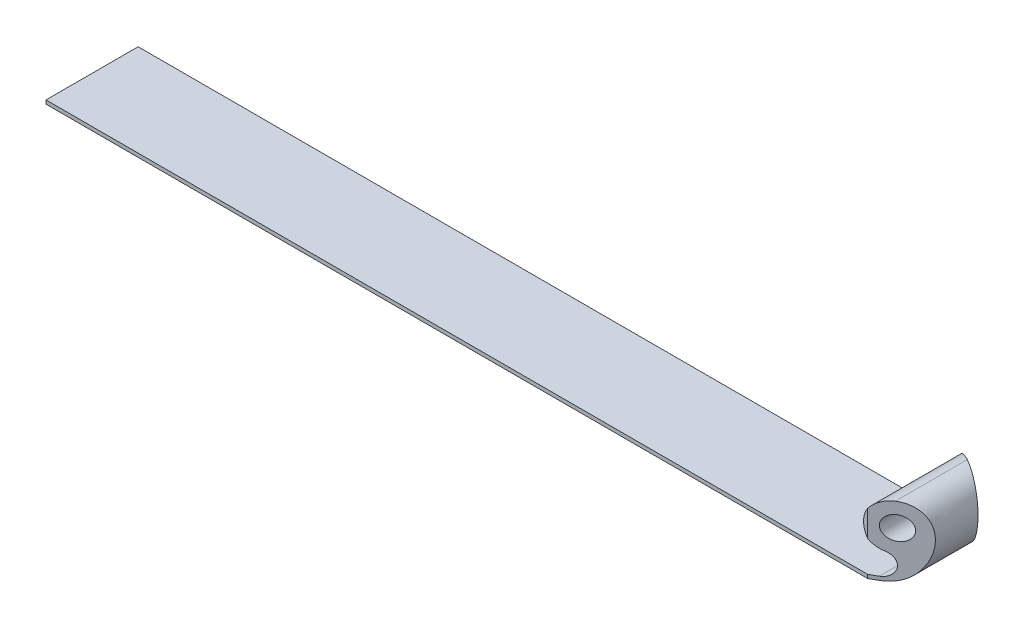
ISO-10303-21;
HEADER;
FILE_DESCRIPTION(('STEP AP214'),'2;1');
FILE_NAME('part.step','',(''),(''),'','','');
FILE_SCHEMA(('AUTOMOTIVE_DESIGN { 1 0 10303 214 1 1 1 1 }'));
ENDSEC;
DATA;
#1=APPLICATION_CONTEXT('core data for automotive mechanical design processes');
#2=APPLICATION_PROTOCOL_DEFINITION('international standard','automotive_design',2000,#1);
#3=PRODUCT_CONTEXT('',#1,'mechanical');
#4=PRODUCT('Part','Part','',(#3));
#5=PRODUCT_RELATED_PRODUCT_CATEGORY('part','',(#4));
#6=PRODUCT_DEFINITION_FORMATION('','',#4);
#7=PRODUCT_DEFINITION_CONTEXT('part definition',#1,'design');
#8=PRODUCT_DEFINITION('design','',#6,#7);
#9=PRODUCT_DEFINITION_SHAPE('','',#8);
#10=(LENGTH_UNIT() NAMED_UNIT(*) SI_UNIT(.MILLI.,.METRE.));
#11=(NAMED_UNIT(*) PLANE_ANGLE_UNIT() SI_UNIT($,.RADIAN.));
#12=(NAMED_UNIT(*) SI_UNIT($,.STERADIAN.) SOLID_ANGLE_UNIT());
#13=UNCERTAINTY_MEASURE_WITH_UNIT(LENGTH_MEASURE(1.E-05),#10,'distance_accuracy_value','');
#14=(GEOMETRIC_REPRESENTATION_CONTEXT(3) GLOBAL_UNCERTAINTY_ASSIGNED_CONTEXT((#13)) GLOBAL_UNIT_ASSIGNED_CONTEXT((#10,
#11,#12)) REPRESENTATION_CONTEXT('',''));
#15=CARTESIAN_POINT('',(0.,0.,0.));
#16=DIRECTION('',(0.,0.,1.));
#17=DIRECTION('',(1.,0.,0.));
#18=AXIS2_PLACEMENT_3D('',#15,#16,#17);
#19=CARTESIAN_POINT('',(0.,1.016,-12.7));
#20=DIRECTION('',(0.,0.,1.));
#21=DIRECTION('',(1.,0.,0.));
#22=AXIS2_PLACEMENT_3D('',#19,#20,#21);
#23=PLANE('',#22);
#24=CARTESIAN_POINT('',(231.775,13.1712561210692,-12.7));
#25=DIRECTION('',(0.,0.,-1.));
#26=DIRECTION('',(-1.,0.,0.));
#27=AXIS2_PLACEMENT_3D('',#24,#25,#26);
#28=CIRCLE('',#27,6.35);
#29=CARTESIAN_POINT('',(226.576403152688,9.52473849199963,-12.7));
#30=VERTEX_POINT('',#29);
#31=CARTESIAN_POINT('',(226.576403152688,16.8177737501387,-12.7));
#32=VERTEX_POINT('',#31);
#33=EDGE_CURVE('E236',#30,#32,#28,.T.);
#34=ORIENTED_EDGE('',*,*,#33,.T.);
#35=DIRECTION('',(0.,-1.,0.));
#36=VECTOR('',#35,1.);
#37=CARTESIAN_POINT('',(226.576403152688,19.6595705539557,-12.7));
#38=LINE('',#37,#36);
#39=EDGE_CURVE('E132',#32,#30,#38,.T.);
#40=ORIENTED_EDGE('',*,*,#39,.T.);
#41=EDGE_LOOP('',(#34,#40));
#42=FACE_BOUND('',#41,.T.);
#43=ADVANCED_FACE('F33',(#42),#23,.F.);
#44=CARTESIAN_POINT('',(0.,1.016,12.7));
#45=DIRECTION('',(0.,0.,-1.));
#46=DIRECTION('',(-1.,0.,0.));
#47=AXIS2_PLACEMENT_3D('',#44,#45,#46);
#48=PLANE('',#47);
#49=DIRECTION('',(1.,0.,0.));
#50=VECTOR('',#49,1.);
#51=CARTESIAN_POINT('',(0.,0.,12.7));
#52=LINE('',#51,#50);
#53=CARTESIAN_POINT('',(0.,0.,12.7));
#54=VERTEX_POINT('',#53);
#55=CARTESIAN_POINT('',(226.576403152688,0.,12.7));
#56=VERTEX_POINT('',#55);
#57=EDGE_CURVE('E128',#54,#56,#52,.T.);
#58=ORIENTED_EDGE('',*,*,#57,.T.);
#59=DIRECTION('',(0.,-1.,0.));
#60=VECTOR('',#59,1.);
#61=CARTESIAN_POINT('',(226.576403152688,19.6595705539557,12.7));
#62=LINE('',#61,#60);
#63=CARTESIAN_POINT('',(226.576403152688,1.016,12.7));
#64=VERTEX_POINT('',#63);
#65=EDGE_CURVE('E110',#64,#56,#62,.T.);
#66=ORIENTED_EDGE('',*,*,#65,.F.);
#67=DIRECTION('',(1.,0.,0.));
#68=VECTOR('',#67,1.);
#69=CARTESIAN_POINT('',(0.,1.016,12.7));
#70=LINE('',#69,#68);
#71=CARTESIAN_POINT('',(0.,1.016,12.7));
#72=VERTEX_POINT('',#71);
#73=EDGE_CURVE('E147',#72,#64,#70,.T.);
#74=ORIENTED_EDGE('',*,*,#73,.F.);
#75=DIRECTION('',(0.,-1.,0.));
#76=VECTOR('',#75,1.);
#77=CARTESIAN_POINT('',(0.,1.016,12.7));
#78=LINE('',#77,#76);
#79=EDGE_CURVE('E42',#72,#54,#78,.T.);
#80=ORIENTED_EDGE('',*,*,#79,.T.);
#81=EDGE_LOOP('',(#58,#66,#74,#80));
#82=FACE_BOUND('',#81,.T.);
#83=ADVANCED_FACE('F135',(#82),#48,.F.);
#84=DIRECTION('',(-1.,0.,0.));
#85=VECTOR('',#84,1.);
#86=CARTESIAN_POINT('',(0.,1.016,-12.7));
#87=LINE('',#86,#85);
#88=CARTESIAN_POINT('',(226.576403152688,1.016,-12.7));
#89=VERTEX_POINT('',#88);
#90=CARTESIAN_POINT('',(0.,1.016,-12.7));
#91=VERTEX_POINT('',#90);
#92=EDGE_CURVE('E141',#89,#91,#87,.T.);
#93=ORIENTED_EDGE('',*,*,#92,.F.);
#94=CARTESIAN_POINT('',(226.576403152688,0.,-12.7));
#95=VERTEX_POINT('',#94);
#96=EDGE_CURVE('E158',#89,#95,#38,.T.);
#97=ORIENTED_EDGE('',*,*,#96,.T.);
#98=DIRECTION('',(-1.,0.,0.));
#99=VECTOR('',#98,1.);
#100=CARTESIAN_POINT('',(0.,0.,-12.7));
#101=LINE('',#100,#99);
#102=CARTESIAN_POINT('',(0.,0.,-12.7));
#103=VERTEX_POINT('',#102);
#104=EDGE_CURVE('E143',#95,#103,#101,.T.);
#105=ORIENTED_EDGE('',*,*,#104,.T.);
#106=DIRECTION('',(0.,-1.,0.));
#107=VECTOR('',#106,1.);
#108=CARTESIAN_POINT('',(0.,1.016,-12.7));
#109=LINE('',#108,#107);
#110=EDGE_CURVE('E11',#91,#103,#109,.T.);
#111=ORIENTED_EDGE('',*,*,#110,.F.);
#112=EDGE_LOOP('',(#93,#97,#105,#111));
#113=FACE_BOUND('',#112,.T.);
#114=ADVANCED_FACE('F35',(#113),#23,.F.);
#115=CARTESIAN_POINT('',(0.,1.016,12.7));
#116=DIRECTION('',(1.,0.,0.));
#117=DIRECTION('',(0.,0.,-1.));
#118=AXIS2_PLACEMENT_3D('',#115,#116,#117);
#119=PLANE('',#118);
#120=DIRECTION('',(0.,0.,1.));
#121=VECTOR('',#120,1.);
#122=CARTESIAN_POINT('',(0.,0.,12.7));
#123=LINE('',#122,#121);
#124=EDGE_CURVE('E138',#103,#54,#123,.T.);
#125=ORIENTED_EDGE('',*,*,#124,.T.);
#126=ORIENTED_EDGE('',*,*,#79,.F.);
#127=DIRECTION('',(0.,0.,1.));
#128=VECTOR('',#127,1.);
#129=CARTESIAN_POINT('',(0.,1.016,12.7));
#130=LINE('',#129,#128);
#131=EDGE_CURVE('E213',#91,#72,#130,.T.);
#132=ORIENTED_EDGE('',*,*,#131,.F.);
#133=ORIENTED_EDGE('',*,*,#110,.T.);
#134=EDGE_LOOP('',(#125,#126,#132,#133));
#135=FACE_BOUND('',#134,.T.);
#136=ADVANCED_FACE('F202',(#135),#119,.F.);
#137=CARTESIAN_POINT('',(231.775,13.1712561210692,12.7));
#138=DIRECTION('',(0.,0.,-1.));
#139=DIRECTION('',(-1.,0.,0.));
#140=AXIS2_PLACEMENT_3D('',#137,#138,#139);
#141=CIRCLE('',#140,6.35);
#142=CARTESIAN_POINT('',(226.576403152688,9.52473849199965,12.7));
#143=VERTEX_POINT('',#142);
#144=CARTESIAN_POINT('',(226.576403152688,16.8177737501387,12.7));
#145=VERTEX_POINT('',#144);
#146=EDGE_CURVE('E232',#143,#145,#141,.T.);
#147=ORIENTED_EDGE('',*,*,#146,.F.);
#148=EDGE_CURVE('E50',#145,#143,#62,.T.);
#149=ORIENTED_EDGE('',*,*,#148,.F.);
#150=EDGE_LOOP('',(#147,#149));
#151=FACE_BOUND('',#150,.T.);
#152=ADVANCED_FACE('F199',(#151),#48,.F.);
#153=CARTESIAN_POINT('',(0.,1.016,0.));
#154=DIRECTION('',(0.,-1.,0.));
#155=DIRECTION('',(0.,0.,-1.));
#156=AXIS2_PLACEMENT_3D('',#153,#154,#155);
#157=PLANE('',#156);
#158=ORIENTED_EDGE('',*,*,#73,.T.);
#159=DIRECTION('',(0.866025403784438,0.,-0.500000000000001));
#160=VECTOR('',#159,1.);
#161=CARTESIAN_POINT('',(62.1433621022032,1.016,107.635460514166));
#162=LINE('',#161,#160);
#163=CARTESIAN_POINT('',(228.6,1.016,11.5316758154729));
#164=VERTEX_POINT('',#163);
#165=EDGE_CURVE('E117',#64,#164,#162,.T.);
#166=ORIENTED_EDGE('',*,*,#165,.T.);
#167=DIRECTION('',(0.,0.,-1.));
#168=VECTOR('',#167,1.);
#169=CARTESIAN_POINT('',(228.6,1.016,12.7));
#170=LINE('',#169,#168);
#171=CARTESIAN_POINT('',(228.6,1.016,-11.531675815473));
#172=VERTEX_POINT('',#171);
#173=EDGE_CURVE('E137',#164,#172,#170,.T.);
#174=ORIENTED_EDGE('',*,*,#173,.T.);
#175=DIRECTION('',(-0.866025403784438,0.,-0.500000000000001));
#176=VECTOR('',#175,1.);
#177=CARTESIAN_POINT('',(62.1433621022032,1.016,-107.635460514166));
#178=LINE('',#177,#176);
#179=EDGE_CURVE('E162',#172,#89,#178,.T.);
#180=ORIENTED_EDGE('',*,*,#179,.T.);
#181=ORIENTED_EDGE('',*,*,#92,.T.);
#182=ORIENTED_EDGE('',*,*,#131,.T.);
#183=EDGE_LOOP('',(#158,#166,#174,#180,#181,#182));
#184=FACE_BOUND('',#183,.T.);
#185=ADVANCED_FACE('F220',(#184),#157,.F.);
#186=CARTESIAN_POINT('',(0.,0.,0.));
#187=DIRECTION('',(0.,-1.,0.));
#188=DIRECTION('',(0.,0.,-1.));
#189=AXIS2_PLACEMENT_3D('',#186,#187,#188);
#190=PLANE('',#189);
#191=DIRECTION('',(0.866025403784438,0.,-0.500000000000001));
#192=VECTOR('',#191,1.);
#193=CARTESIAN_POINT('',(226.576403152688,0.,12.7));
#194=LINE('',#193,#192);
#195=CARTESIAN_POINT('',(228.6,0.,11.5316758154729));
#196=VERTEX_POINT('',#195);
#197=EDGE_CURVE('E114',#56,#196,#194,.T.);
#198=ORIENTED_EDGE('',*,*,#197,.F.);
#199=ORIENTED_EDGE('',*,*,#57,.F.);
#200=ORIENTED_EDGE('',*,*,#124,.F.);
#201=ORIENTED_EDGE('',*,*,#104,.F.);
#202=DIRECTION('',(-0.866025403784438,0.,-0.500000000000001));
#203=VECTOR('',#202,1.);
#204=CARTESIAN_POINT('',(226.576403152688,0.,-12.7));
#205=LINE('',#204,#203);
#206=CARTESIAN_POINT('',(228.6,0.,-11.531675815473));
#207=VERTEX_POINT('',#206);
#208=EDGE_CURVE('E156',#207,#95,#205,.T.);
#209=ORIENTED_EDGE('',*,*,#208,.F.);
#210=DIRECTION('',(0.,0.,-1.));
#211=VECTOR('',#210,1.);
#212=CARTESIAN_POINT('',(228.6,0.,12.7));
#213=LINE('',#212,#211);
#214=EDGE_CURVE('E131',#196,#207,#213,.T.);
#215=ORIENTED_EDGE('',*,*,#214,.F.);
#216=EDGE_LOOP('',(#198,#199,#200,#201,#209,#215));
#217=FACE_BOUND('',#216,.T.);
#218=ADVANCED_FACE('F126',(#217),#190,.T.);
#219=CARTESIAN_POINT('',(228.6,4.191,12.7));
#220=DIRECTION('',(0.,0.,-1.));
#221=DIRECTION('',(-1.,0.,0.));
#222=AXIS2_PLACEMENT_3D('',#219,#220,#221);
#223=CYLINDRICAL_SURFACE('',#222,3.175);
#224=CARTESIAN_POINT('',(228.6,4.191,11.531675815473));
#225=DIRECTION('',(-0.500000000000001,0.,-0.866025403784438));
#226=DIRECTION('',(0.866025403784438,0.,-0.500000000000001));
#227=AXIS2_PLACEMENT_3D('',#224,#225,#226);
#228=ELLIPSE('',#227,3.66617420935412,3.175);
#229=CARTESIAN_POINT('',(229.658333333333,7.18441870702305,10.9206467805806));
#230=VERTEX_POINT('',#229);
#231=EDGE_CURVE('E223',#230,#164,#228,.T.);
#232=ORIENTED_EDGE('',*,*,#231,.F.);
#233=DIRECTION('',(0.,0.,-1.));
#234=VECTOR('',#233,1.);
#235=CARTESIAN_POINT('',(229.658333333333,7.18441870702305,12.7));
#236=LINE('',#235,#234);
#237=CARTESIAN_POINT('',(229.658333333333,7.18441870702305,-10.9206467805806));
#238=VERTEX_POINT('',#237);
#239=EDGE_CURVE('E230',#230,#238,#236,.T.);
#240=ORIENTED_EDGE('',*,*,#239,.T.);
#241=CARTESIAN_POINT('',(228.6,4.191,-11.531675815473));
#242=DIRECTION('',(-0.500000000000001,0.,0.866025403784438));
#243=DIRECTION('',(-0.866025403784438,0.,-0.500000000000001));
#244=AXIS2_PLACEMENT_3D('',#241,#242,#243);
#245=ELLIPSE('',#244,3.66617420935412,3.175);
#246=EDGE_CURVE('E58',#172,#238,#245,.T.);
#247=ORIENTED_EDGE('',*,*,#246,.F.);
#248=ORIENTED_EDGE('',*,*,#173,.F.);
#249=EDGE_LOOP('',(#232,#240,#247,#248));
#250=FACE_BOUND('',#249,.T.);
#251=ADVANCED_FACE('F227',(#250),#223,.F.);
#252=CARTESIAN_POINT('',(231.38123789868,19.5090358117467,12.7));
#253=CARTESIAN_POINT('',(236.227087860959,19.8101052961647,12.7));
#254=CARTESIAN_POINT('',(241.340763981735,15.1060283719887,12.7));
#255=CARTESIAN_POINT('',(239.097965646525,8.03162983332433,12.7));
#256=CARTESIAN_POINT('',(236.573095562569,0.,12.7));
#257=CARTESIAN_POINT('',(228.6,0.,12.7));
#258=B_SPLINE_CURVE_WITH_KNOTS('',5,(#252,#253,#254,#255,#256,#257),.UNSPECIFIED.,.F.,.F.,(6,6),
(0.,1.),.UNSPECIFIED.);
#259=DIRECTION('',(0.,0.,-1.));
#260=VECTOR('',#259,1.);
#261=SURFACE_OF_LINEAR_EXTRUSION('',#258,#260);
#262=CARTESIAN_POINT('',(228.6,0.,11.5316758154729));
#263=CARTESIAN_POINT('',(228.774822040463,-9.49278637033649E-06,11.4307422633511));
#264=CARTESIAN_POINT('',(228.949670058046,0.00463314932721364,11.3297937133328));
#265=CARTESIAN_POINT('',(229.299159344152,0.0237665320454884,11.1280159799205));
#266=CARTESIAN_POINT('',(229.473800142951,0.0382686035590656,11.0271870677222));
#267=CARTESIAN_POINT('',(229.822264715094,0.0776731636921122,10.8260009531922));
#268=CARTESIAN_POINT('',(229.996088223416,0.102578818399091,10.7256439038711));
#269=CARTESIAN_POINT('',(230.342286291478,0.16322318177325,10.5257663560826));
#270=CARTESIAN_POINT('',(230.514661110646,0.198959906444537,10.4262457078348));
#271=CARTESIAN_POINT('',(230.857340568932,0.281583661291981,10.2283996303474));
#272=CARTESIAN_POINT('',(231.027645892226,0.328466894856992,10.1300738060992));
#273=CARTESIAN_POINT('',(231.365591377373,0.433574467425711,9.934960889278));
#274=CARTESIAN_POINT('',(231.533231900128,0.491797256280907,9.83817358833857));
#275=CARTESIAN_POINT('',(231.866220935901,0.620008015462059,9.64592227889765));
#276=CARTESIAN_POINT('',(232.031549787319,0.690064157687513,9.55046962202682));
#277=CARTESIAN_POINT('',(232.358274736072,0.841585100451611,9.36183488491301));
#278=CARTESIAN_POINT('',(232.519670120788,0.923051950475404,9.2686532161013));
#279=CARTESIAN_POINT('',(232.837899493955,1.09710282454696,9.08492340183956));
#280=CARTESIAN_POINT('',(232.994733496139,1.18968681511824,8.99437524846038));
#281=CARTESIAN_POINT('',(233.303090692569,1.38541486626073,8.81634513809504));
#282=CARTESIAN_POINT('',(233.454620982543,1.48854403233519,8.72885908438802));
#283=CARTESIAN_POINT('',(233.75214600079,1.70494248670347,8.5570829350123));
#284=CARTESIAN_POINT('',(233.898140784925,1.81821167263034,8.47279280709187));
#285=CARTESIAN_POINT('',(234.184209902178,2.05427133863962,8.30763072523939));
#286=CARTESIAN_POINT('',(234.324284562963,2.17706129069691,8.22675858212848));
#287=CARTESIAN_POINT('',(234.655301541494,2.48453773602357,8.0356458404671));
#288=CARTESIAN_POINT('',(234.843136883768,2.67370699435915,7.92719905504202));
#289=CARTESIAN_POINT('',(235.205852957699,3.06807692508691,7.71778483211849));
#290=CARTESIAN_POINT('',(235.380727019972,3.27328574077407,7.61682124519053));
#291=CARTESIAN_POINT('',(235.717261471515,3.69809504249263,7.42252298900108));
#292=CARTESIAN_POINT('',(235.878906220628,3.91771202537876,7.32919734958745));
#293=CARTESIAN_POINT('',(236.188448413896,4.36936512236561,7.15048308097877));
#294=CARTESIAN_POINT('',(236.336349916417,4.60139753810313,7.06509210868465));
#295=CARTESIAN_POINT('',(236.638997632073,5.11140656951273,6.89035836858069));
#296=CARTESIAN_POINT('',(236.791550696922,5.3911209763456,6.80228181552473));
#297=CARTESIAN_POINT('',(237.077987304288,5.96303696967691,6.63690756315589));
#298=CARTESIAN_POINT('',(237.211868624557,6.25524003713678,6.55961114685922));
#299=CARTESIAN_POINT('',(237.460412064233,6.85045837934706,6.41611452505701));
#300=CARTESIAN_POINT('',(237.575068393762,7.15347687811276,6.34991766233913));
#301=CARTESIAN_POINT('',(237.784252456157,7.76862510711678,6.22914518760547));
#302=CARTESIAN_POINT('',(237.878782204335,8.08075392155971,6.17456841204839));
#303=CARTESIAN_POINT('',(238.040255222398,8.68897777142522,6.08134192160279));
#304=CARTESIAN_POINT('',(238.10873119455,8.98453001142305,6.04180730064784));
#305=CARTESIAN_POINT('',(238.226170673341,9.58081469021834,5.97400358595417));
#306=CARTESIAN_POINT('',(238.27513316866,9.88154739666019,5.94573507610153));
#307=CARTESIAN_POINT('',(238.351913577063,10.4861847660371,5.90140588664182));
#308=CARTESIAN_POINT('',(238.37976183045,10.7900842389793,5.88532769005192));
#309=CARTESIAN_POINT('',(238.412575461662,11.3996512715496,5.86638273123873));
#310=CARTESIAN_POINT('',(238.417538338988,11.7053190207297,5.86351741267875));
#311=CARTESIAN_POINT('',(238.404358949858,12.2410494108918,5.87112653654053));
#312=CARTESIAN_POINT('',(238.391577475259,12.4712950262164,5.87850592434094));
#313=CARTESIAN_POINT('',(238.350901338711,12.9299042872809,5.90199030272641));
#314=CARTESIAN_POINT('',(238.323015558083,13.1582689589849,5.91809016567866));
#315=CARTESIAN_POINT('',(238.251309562527,13.6115773570488,5.95948964151568));
#316=CARTESIAN_POINT('',(238.20749546231,13.8365223617051,5.98478572407034));
#317=CARTESIAN_POINT('',(238.103244707401,14.2812539662906,6.04497492548031));
#318=CARTESIAN_POINT('',(238.04280786858,14.5010405090507,6.07986815064211));
#319=CARTESIAN_POINT('',(237.904266730397,14.9353419234501,6.15985491406633));
#320=CARTESIAN_POINT('',(237.826008454484,15.1497916225783,6.20503735073076));
#321=CARTESIAN_POINT('',(237.652081840296,15.569091207905,6.30545392825139));
#322=CARTESIAN_POINT('',(237.556413482187,15.7739410831665,6.36068808055893));
#323=CARTESIAN_POINT('',(237.348134932937,16.1716758935922,6.48093775703467));
#324=CARTESIAN_POINT('',(237.23553420874,16.3645674301284,6.54594781546083));
#325=CARTESIAN_POINT('',(236.994242789343,16.736414525899,6.68525748140268));
#326=CARTESIAN_POINT('',(236.865554011924,16.9153717420582,6.75955598168715));
#327=CARTESIAN_POINT('',(236.611667798126,17.2346351643841,6.90613725556716));
#328=CARTESIAN_POINT('',(236.488315818205,17.3769064801637,6.97735455437954));
#329=CARTESIAN_POINT('',(236.231573443558,17.6488085019016,7.12558483349437));
#330=CARTESIAN_POINT('',(236.098183030229,17.7784391844332,7.20259782453742));
#331=CARTESIAN_POINT('',(235.822467330644,18.0244299147893,7.36178235791218));
#332=CARTESIAN_POINT('',(235.680139672404,18.1407864163082,7.44395526971026));
#333=CARTESIAN_POINT('',(235.3877992457,18.3597413370411,7.61273809376298));
#334=CARTESIAN_POINT('',(235.237786171194,18.4623392077825,7.69934818271066));
#335=CARTESIAN_POINT('',(234.774964913666,18.7509391750439,7.96655816033111));
#336=CARTESIAN_POINT('',(234.451927172861,18.915492478831,8.15306408694343));
#337=CARTESIAN_POINT('',(233.788191825639,19.1865070045924,8.53627186833259));
#338=CARTESIAN_POINT('',(233.447493588223,19.2929661493246,8.73297408741755));
#339=CARTESIAN_POINT('',(232.960529968126,19.4017252250287,9.01412266456613));
#340=CARTESIAN_POINT('',(232.818090320734,19.4284264419023,9.09636023333113));
#341=CARTESIAN_POINT('',(232.532071269961,19.471872073179,9.26149340928826));
#342=CARTESIAN_POINT('',(232.388492047593,19.4886180380485,9.34438891197246));
#343=CARTESIAN_POINT('',(232.100983667384,19.5119858598742,9.51038195268003));
#344=CARTESIAN_POINT('',(231.957055629883,19.518626177803,9.5934788438754));
#345=CARTESIAN_POINT('',(231.669088535123,19.5216125513273,9.75973672355294));
#346=CARTESIAN_POINT('',(231.525049459998,19.5179562513943,9.84289772235013));
#347=CARTESIAN_POINT('',(231.38123789868,19.5090358117467,9.92592736598955));
#348=B_SPLINE_CURVE_WITH_KNOTS('',3,(#262,#263,#264,#265,#266,#267,#268,#269,#270,#271,#272,
#273,#274,#275,#276,#277,#278,#279,#280,#281,#282,#283,#284,#285,#286,#287,#288,#289,#290,#291,
#292,#293,#294,#295,#296,#297,#298,#299,#300,#301,#302,#303,#304,#305,#306,#307,#308,#309,#310,
#311,#312,#313,#314,#315,#316,#317,#318,#319,#320,#321,#322,#323,#324,#325,#326,#327,#328,#329,
#330,#331,#332,#333,#334,#335,#336,#337,#338,#339,#340,#341,#342,#343,#344,#345,#346,#347),
.UNSPECIFIED.,.F.,.F.,(4,2,2,2,2,2,2,2,2,2,2,2,2,2,2,2,2,2,2,2,2,2,2,2,2,2,2,2,2,2,2,2,2,2,2,2,
2,2,2,2,2,2,4),(0.,0.605592233713117,1.21188162093452,1.81835565274614,2.42471865992984,
3.03087542901997,3.6369493928945,4.24664210443803,4.85644446407337,5.46624498748723,
6.07519579582714,6.68414045729475,7.2930513705952,8.15552082275231,9.01843103156645,
9.88234709350047,10.7460072257327,11.7367035633329,12.7275177098947,13.7186297202781,
14.7096424420184,15.6266650106289,16.5437350993725,17.4594848851245,18.3753347250086,
19.0668931285052,19.7580453369169,20.4489324990985,21.1398273144694,21.8369345488758,
22.534042577461,23.2307622898495,23.9273990286277,24.5306289197424,25.1338599287935,
25.7372517203715,26.3406675583453,27.5585033110273,28.7763826063657,29.2760414287873,
29.7756224121528,30.2742896619642,30.7730709997576),.UNSPECIFIED.);
#349=CARTESIAN_POINT('',(231.38123789868,19.5090358117467,9.92592736598955));
#350=VERTEX_POINT('',#349);
#351=EDGE_CURVE('E239',#196,#350,#348,.T.);
#352=ORIENTED_EDGE('',*,*,#351,.F.);
#353=ORIENTED_EDGE('',*,*,#214,.T.);
#354=CARTESIAN_POINT('',(231.38123789868,19.5090358117467,-9.92592736598955));
#355=CARTESIAN_POINT('',(231.570360798555,19.5207459839053,-9.81673720883689));
#356=CARTESIAN_POINT('',(231.759869912565,19.5233827029867,-9.70732407084948));
#357=CARTESIAN_POINT('',(232.138435621058,19.5109696750389,-9.48875905714491));
#358=CARTESIAN_POINT('',(232.327492266553,19.495922025945,-9.37960715197628));
#359=CARTESIAN_POINT('',(232.704525390376,19.4485338996337,-9.16192697644354));
#360=CARTESIAN_POINT('',(232.892497077097,19.416142854639,-9.0534014725153));
#361=CARTESIAN_POINT('',(233.265641536171,19.3342676867628,-8.83796641862227));
#362=CARTESIAN_POINT('',(233.450814152383,19.2847826139684,-8.73105695880553));
#363=CARTESIAN_POINT('',(233.817157351805,19.1688462661406,-8.51954861400349));
#364=CARTESIAN_POINT('',(233.998327560081,19.1023934088766,-8.41494994548626));
#365=CARTESIAN_POINT('',(234.35535254442,18.9526040741312,-8.20882147467105));
#366=CARTESIAN_POINT('',(234.531207696293,18.8692687935785,-8.10729145539834));
#367=CARTESIAN_POINT('',(234.876131601445,18.6858669142676,-7.90814954590894));
#368=CARTESIAN_POINT('',(235.045204478865,18.5858106803996,-7.81053527461803));
#369=CARTESIAN_POINT('',(235.375124337569,18.3691939191098,-7.6200559553845));
#370=CARTESIAN_POINT('',(235.535975632209,18.2526421693901,-7.52718841712428));
#371=CARTESIAN_POINT('',(235.84875376458,18.002812084113,-7.34660587820352));
#372=CARTESIAN_POINT('',(236.00063545258,17.8694582304717,-7.25891694475188));
#373=CARTESIAN_POINT('',(236.293113366603,17.5871400070486,-7.09005474235859));
#374=CARTESIAN_POINT('',(236.43370962536,17.4381756825479,-7.00888145451825));
#375=CARTESIAN_POINT('',(236.702103640265,17.1257384130257,-6.85392409776386));
#376=CARTESIAN_POINT('',(236.829907961912,16.9622729928477,-6.78013623825719));
#377=CARTESIAN_POINT('',(237.071558425036,16.6221335709435,-6.6406192783228));
#378=CARTESIAN_POINT('',(237.185405686058,16.4454606304719,-6.57488953152523));
#379=CARTESIAN_POINT('',(237.388022188625,16.0980516936193,-6.4579088392258));
#380=CARTESIAN_POINT('',(237.478148963237,15.928367592792,-6.40587412164244));
#381=CARTESIAN_POINT('',(237.645814545496,15.5809228735122,-6.30907235259114));
#382=CARTESIAN_POINT('',(237.723354299097,15.4031628632748,-6.26430475497725));
#383=CARTESIAN_POINT('',(237.865687339126,15.0409610100459,-6.18212873600172));
#384=CARTESIAN_POINT('',(237.930479458298,14.8565185569953,-6.14472098855645));
#385=CARTESIAN_POINT('',(238.047384439076,14.4823611654647,-6.07722586643437));
#386=CARTESIAN_POINT('',(238.099496583181,14.2926459292984,-6.04713890600749));
#387=CARTESIAN_POINT('',(238.19306091615,13.9019475444322,-5.9931195131814));
#388=CARTESIAN_POINT('',(238.23403081062,13.7008105907529,-5.96946553358036));
#389=CARTESIAN_POINT('',(238.303078736407,13.2955970026473,-5.92960069504022));
#390=CARTESIAN_POINT('',(238.33115264211,13.0915194489851,-5.91339221802515));
#391=CARTESIAN_POINT('',(238.396888615061,12.4765162652932,-5.87543953634671));
#392=CARTESIAN_POINT('',(238.416069728089,12.0627994034698,-5.86436531557686));
#393=CARTESIAN_POINT('',(238.410920666216,11.3318373480931,-5.86733812783489));
#394=CARTESIAN_POINT('',(238.395617179633,11.0143810974854,-5.87617359993349));
#395=CARTESIAN_POINT('',(238.341156680175,10.3821911225736,-5.90761638395532));
#396=CARTESIAN_POINT('',(238.30199913658,10.0674574590017,-5.93022400229089));
#397=CARTESIAN_POINT('',(238.201682263097,9.44221357876221,-5.9881419762005));
#398=CARTESIAN_POINT('',(238.140485676232,9.13171144357299,-6.02347384210049));
#399=CARTESIAN_POINT('',(237.997708956354,8.51708179262743,-6.10590601975617));
#400=CARTESIAN_POINT('',(237.91613090503,8.21295362929301,-6.15300512964821));
#401=CARTESIAN_POINT('',(237.732115034458,7.60683742019199,-6.25924674205812));
#402=CARTESIAN_POINT('',(237.629314929625,7.30499630355853,-6.31859841025593));
#403=CARTESIAN_POINT('',(237.404800405759,6.71084889967745,-6.44822193104733));
#404=CARTESIAN_POINT('',(237.283085793415,6.41854270991515,-6.51849389524795));
#405=CARTESIAN_POINT('',(237.021343464138,5.84488680203565,-6.66961089951444));
#406=CARTESIAN_POINT('',(236.881307036722,5.56354237840765,-6.75046096857945));
#407=CARTESIAN_POINT('',(236.583406956377,5.01369128008215,-6.92245366015852));
#408=CARTESIAN_POINT('',(236.425541655726,4.74518579521202,-7.01359723398485));
#409=CARTESIAN_POINT('',(236.06903331848,4.18655819689871,-7.21942741846236));
#410=CARTESIAN_POINT('',(235.867774119098,3.89864954002356,-7.33562447140214));
#411=CARTESIAN_POINT('',(235.442981735382,3.34551973278537,-7.5808784684906));
#412=CARTESIAN_POINT('',(235.21944627322,3.08030090770209,-7.70993672774337));
#413=CARTESIAN_POINT('',(234.751416453465,2.57699938219265,-7.98015387016765));
#414=CARTESIAN_POINT('',(234.506970672374,2.33885662887095,-8.12128470768283));
#415=CARTESIAN_POINT('',(233.998027490577,1.89304141063325,-8.41512319069529));
#416=CARTESIAN_POINT('',(233.73353584478,1.68536025046716,-8.56782751359444));
#417=CARTESIAN_POINT('',(233.302479596721,1.38478912363976,-8.81669795444743));
#418=CARTESIAN_POINT('',(233.14180297467,1.28049583765681,-8.90946464544125));
#419=CARTESIAN_POINT('',(232.815066130219,1.08379747338641,-9.09810625053889));
#420=CARTESIAN_POINT('',(232.649006090285,0.991391992700372,-9.19398105929626));
#421=CARTESIAN_POINT('',(232.312160477305,0.818909403164954,-9.38845896462611));
#422=CARTESIAN_POINT('',(232.14137498783,0.738832076447084,-9.48706201294761));
#423=CARTESIAN_POINT('',(231.795601731389,0.591168959852226,-9.68669429563259));
#424=CARTESIAN_POINT('',(231.620609811342,0.523596140673199,-9.7877259277777));
#425=CARTESIAN_POINT('',(231.267344010683,0.401098135194693,-9.99168403288399));
#426=CARTESIAN_POINT('',(231.089070138204,0.346172917554138,-10.094610501149));
#427=CARTESIAN_POINT('',(230.730045199043,0.248843169533055,-10.3018936464193));
#428=CARTESIAN_POINT('',(230.549294997047,0.206434379671684,-10.4062498241982));
#429=CARTESIAN_POINT('',(230.221484930207,0.140887321610886,-10.595511054531));
#430=CARTESIAN_POINT('',(230.074742994669,0.115602827149692,-10.6802325505151));
#431=CARTESIAN_POINT('',(229.7804691431,0.0726803256142577,-10.8501316379339));
#432=CARTESIAN_POINT('',(229.632937436305,0.055040385788391,-10.935309108566));
#433=CARTESIAN_POINT('',(229.190795878886,0.013239420903873,-11.1905796557621));
#434=CARTESIAN_POINT('',(228.895379221546,-4.84981759601165E-05,-11.3611385424002));
#435=CARTESIAN_POINT('',(228.6,0.,-11.5316758154729));
#436=B_SPLINE_CURVE_WITH_KNOTS('',3,(#354,#355,#356,#357,#358,#359,#360,#361,#362,#363,#364,
#365,#366,#367,#368,#369,#370,#371,#372,#373,#374,#375,#376,#377,#378,#379,#380,#381,#382,#383,
#384,#385,#386,#387,#388,#389,#390,#391,#392,#393,#394,#395,#396,#397,#398,#399,#400,#401,#402,
#403,#404,#405,#406,#407,#408,#409,#410,#411,#412,#413,#414,#415,#416,#417,#418,#419,#420,#421,
#422,#423,#424,#425,#426,#427,#428,#429,#430,#431,#432,#433,#434,#435),.UNSPECIFIED.,.F.,.F.,(4,
2,2,2,2,2,2,2,2,2,2,2,2,2,2,2,2,2,2,2,2,2,2,2,2,2,2,2,2,2,2,2,2,2,2,2,2,2,2,2,4),(0.,
0.655835085370498,1.31159237544088,1.96927213869192,2.62698845500173,3.28476612517958,
3.94249717660207,4.59982201951945,5.25679838842999,5.91684060174746,6.57688090053877,
7.23658067558959,7.89622749910516,8.49269873119141,9.08912511589459,9.68560608793571,
10.2821208042678,10.901383260575,11.5208436901675,12.7597008168605,13.7124139759412,
14.665148332425,15.6195009042524,16.5737560417856,17.5458951392193,18.5180441727126,
19.490657072203,20.4633599329779,21.5718240322883,22.6804015925232,23.7864703530108,
24.892222769566,25.5303658997228,26.1684874232432,26.8065976683083,27.4453661480923,
28.0841330449748,28.7226823109963,29.2364630463231,29.7501138079957,30.7730028512967),.UNSPECIFIED.);
#437=CARTESIAN_POINT('',(231.38123789868,19.5090358117467,-9.92592736598955));
#438=VERTEX_POINT('',#437);
#439=EDGE_CURVE('E165',#438,#207,#436,.T.);
#440=ORIENTED_EDGE('',*,*,#439,.F.);
#441=DIRECTION('',(0.,0.,-1.));
#442=VECTOR('',#441,1.);
#443=CARTESIAN_POINT('',(231.38123789868,19.5090358117467,12.7));
#444=LINE('',#443,#442);
#445=EDGE_CURVE('E219',#350,#438,#444,.T.);
#446=ORIENTED_EDGE('',*,*,#445,.F.);
#447=EDGE_LOOP('',(#352,#353,#440,#446));
#448=FACE_BOUND('',#447,.T.);
#449=ADVANCED_FACE('F175',(#448),#261,.T.);
#450=CARTESIAN_POINT('',(231.775,13.1712561210692,12.7));
#451=DIRECTION('',(0.,0.,-1.));
#452=DIRECTION('',(-1.,0.,0.));
#453=AXIS2_PLACEMENT_3D('',#450,#451,#452);
#454=CYLINDRICAL_SURFACE('',#453,6.35);
#455=CARTESIAN_POINT('',(231.775,13.1712561210692,9.69858871079591));
#456=DIRECTION('',(-0.500000000000001,0.,-0.866025403784438));
#457=DIRECTION('',(0.866025403784438,0.,-0.500000000000001));
#458=AXIS2_PLACEMENT_3D('',#455,#456,#457);
#459=ELLIPSE('',#458,7.33234841870825,6.35);
#460=EDGE_CURVE('E222',#350,#145,#459,.F.);
#461=ORIENTED_EDGE('',*,*,#460,.F.);
#462=ORIENTED_EDGE('',*,*,#445,.T.);
#463=CARTESIAN_POINT('',(231.775,13.1712561210692,-9.69858871079591));
#464=DIRECTION('',(-0.500000000000001,0.,0.866025403784438));
#465=DIRECTION('',(-0.866025403784438,0.,-0.500000000000001));
#466=AXIS2_PLACEMENT_3D('',#463,#464,#465);
#467=ELLIPSE('',#466,7.33234841870825,6.35);
#468=EDGE_CURVE('E154',#32,#438,#467,.F.);
#469=ORIENTED_EDGE('',*,*,#468,.F.);
#470=ORIENTED_EDGE('',*,*,#33,.F.);
#471=EDGE_CURVE('E150',#238,#30,#467,.F.);
#472=ORIENTED_EDGE('',*,*,#471,.F.);
#473=ORIENTED_EDGE('',*,*,#239,.F.);
#474=EDGE_CURVE('E173',#143,#230,#459,.F.);
#475=ORIENTED_EDGE('',*,*,#474,.F.);
#476=ORIENTED_EDGE('',*,*,#146,.T.);
#477=EDGE_LOOP('',(#461,#462,#469,#470,#472,#473,#475,#476));
#478=FACE_BOUND('',#477,.T.);
#479=ADVANCED_FACE('F184',(#478),#454,.T.);
#480=CARTESIAN_POINT('',(226.576403152688,19.6595705539557,-12.7));
#481=DIRECTION('',(-0.500000000000001,0.,0.866025403784438));
#482=DIRECTION('',(0.866025403784438,0.,0.500000000000001));
#483=AXIS2_PLACEMENT_3D('',#480,#481,#482);
#484=PLANE('',#483);
#485=ORIENTED_EDGE('',*,*,#439,.T.);
#486=ORIENTED_EDGE('',*,*,#208,.T.);
#487=ORIENTED_EDGE('',*,*,#96,.F.);
#488=ORIENTED_EDGE('',*,*,#179,.F.);
#489=ORIENTED_EDGE('',*,*,#246,.T.);
#490=ORIENTED_EDGE('',*,*,#471,.T.);
#491=ORIENTED_EDGE('',*,*,#39,.F.);
#492=ORIENTED_EDGE('',*,*,#468,.T.);
#493=EDGE_LOOP('',(#485,#486,#487,#488,#489,#490,#491,#492));
#494=FACE_BOUND('',#493,.T.);
#495=CARTESIAN_POINT('',(231.775,13.1712561210692,-9.69858871079591));
#496=DIRECTION('',(-0.500000000000001,0.,0.866025403784438));
#497=DIRECTION('',(-0.866025403784438,0.,-0.500000000000001));
#498=AXIS2_PLACEMENT_3D('',#495,#496,#497);
#499=ELLIPSE('',#498,3.66617420935412,3.175);
#500=CARTESIAN_POINT('',(228.6,13.1712561210692,-11.531675815473));
#501=VERTEX_POINT('',#500);
#502=EDGE_CURVE('E148',#501,#501,#499,.F.);
#503=ORIENTED_EDGE('',*,*,#502,.F.);
#504=EDGE_LOOP('',(#503));
#505=FACE_BOUND('',#504,.T.);
#506=ADVANCED_FACE('F180',(#494,#505),#484,.F.);
#507=CARTESIAN_POINT('',(226.576403152688,19.6595705539557,12.7));
#508=DIRECTION('',(-0.500000000000001,0.,-0.866025403784438));
#509=DIRECTION('',(-0.866025403784438,0.,0.500000000000001));
#510=AXIS2_PLACEMENT_3D('',#507,#508,#509);
#511=PLANE('',#510);
#512=ORIENTED_EDGE('',*,*,#351,.T.);
#513=ORIENTED_EDGE('',*,*,#460,.T.);
#514=ORIENTED_EDGE('',*,*,#148,.T.);
#515=ORIENTED_EDGE('',*,*,#474,.T.);
#516=ORIENTED_EDGE('',*,*,#231,.T.);
#517=ORIENTED_EDGE('',*,*,#165,.F.);
#518=ORIENTED_EDGE('',*,*,#65,.T.);
#519=ORIENTED_EDGE('',*,*,#197,.T.);
#520=EDGE_LOOP('',(#512,#513,#514,#515,#516,#517,#518,#519));
#521=FACE_BOUND('',#520,.T.);
#522=CARTESIAN_POINT('',(231.775,13.1712561210692,9.69858871079591));
#523=DIRECTION('',(-0.500000000000001,0.,-0.866025403784438));
#524=DIRECTION('',(0.866025403784438,0.,-0.500000000000001));
#525=AXIS2_PLACEMENT_3D('',#522,#523,#524);
#526=ELLIPSE('',#525,3.66617420935412,3.175);
#527=CARTESIAN_POINT('',(234.95,13.1712561210692,7.86550160611884));
#528=VERTEX_POINT('',#527);
#529=EDGE_CURVE('E37',#528,#528,#526,.F.);
#530=ORIENTED_EDGE('',*,*,#529,.F.);
#531=EDGE_LOOP('',(#530));
#532=FACE_BOUND('',#531,.T.);
#533=ADVANCED_FACE('F112',(#521,#532),#511,.F.);
#534=CARTESIAN_POINT('',(231.775,13.1712561210692,12.7));
#535=DIRECTION('',(0.,0.,-1.));
#536=DIRECTION('',(-1.,0.,0.));
#537=AXIS2_PLACEMENT_3D('',#534,#535,#536);
#538=CYLINDRICAL_SURFACE('',#537,3.175);
#539=ORIENTED_EDGE('',*,*,#529,.T.);
#540=EDGE_LOOP('',(#539));
#541=FACE_BOUND('',#540,.T.);
#542=ORIENTED_EDGE('',*,*,#502,.T.);
#543=EDGE_LOOP('',(#542));
#544=FACE_BOUND('',#543,.T.);
#545=ADVANCED_FACE('F186',(#541,#544),#538,.F.);
#546=CLOSED_SHELL('',(#43,#83,#114,#136,#152,#185,#218,#251,#449,#479,#506,#533,#545));
#547=MANIFOLD_SOLID_BREP('B2',#546);
#548=ADVANCED_BREP_SHAPE_REPRESENTATION('',(#18,#547),#14);
#549=SHAPE_DEFINITION_REPRESENTATION(#9,#548);
ENDSEC;
END-ISO-10303-21;
